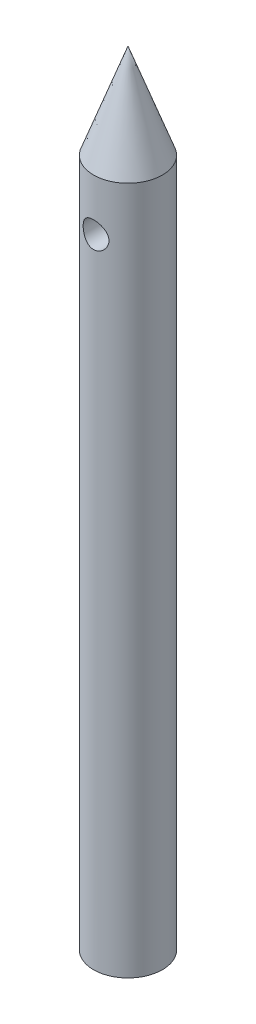
ISO-10303-21;
HEADER;
FILE_DESCRIPTION(('STEP AP214'),'2;1');
FILE_NAME('part.step','',(''),(''),'','','');
FILE_SCHEMA(('AUTOMOTIVE_DESIGN { 1 0 10303 214 1 1 1 1 }'));
ENDSEC;
DATA;
#1=APPLICATION_CONTEXT('core data for automotive mechanical design processes');
#2=APPLICATION_PROTOCOL_DEFINITION('international standard','automotive_design',2000,#1);
#3=PRODUCT_CONTEXT('',#1,'mechanical');
#4=PRODUCT('Part','Part','',(#3));
#5=PRODUCT_RELATED_PRODUCT_CATEGORY('part','',(#4));
#6=PRODUCT_DEFINITION_FORMATION('','',#4);
#7=PRODUCT_DEFINITION_CONTEXT('part definition',#1,'design');
#8=PRODUCT_DEFINITION('design','',#6,#7);
#9=PRODUCT_DEFINITION_SHAPE('','',#8);
#10=(LENGTH_UNIT() NAMED_UNIT(*) SI_UNIT(.MILLI.,.METRE.));
#11=(NAMED_UNIT(*) PLANE_ANGLE_UNIT() SI_UNIT($,.RADIAN.));
#12=(NAMED_UNIT(*) SI_UNIT($,.STERADIAN.) SOLID_ANGLE_UNIT());
#13=UNCERTAINTY_MEASURE_WITH_UNIT(LENGTH_MEASURE(1.E-05),#10,'distance_accuracy_value','');
#14=(GEOMETRIC_REPRESENTATION_CONTEXT(3) GLOBAL_UNCERTAINTY_ASSIGNED_CONTEXT((#13)) GLOBAL_UNIT_ASSIGNED_CONTEXT((#10,
#11,#12)) REPRESENTATION_CONTEXT('',''));
#15=CARTESIAN_POINT('',(0.,0.,0.));
#16=DIRECTION('',(0.,0.,1.));
#17=DIRECTION('',(1.,0.,0.));
#18=AXIS2_PLACEMENT_3D('',#15,#16,#17);
#19=CARTESIAN_POINT('',(0.,40.,0.));
#20=DIRECTION('',(0.,-1.,0.));
#21=DIRECTION('',(0.,0.,1.));
#22=AXIS2_PLACEMENT_3D('',#19,#20,#21);
#23=CONICAL_SURFACE('',#22,2.,0.349065850398867);
#24=CARTESIAN_POINT('',(0.,45.4949548389092,0.));
#25=VERTEX_POINT('',#24);
#26=VERTEX_LOOP('',#25);
#27=FACE_BOUND('',#26,.T.);
#28=CARTESIAN_POINT('',(0.,40.,0.));
#29=DIRECTION('',(0.,1.,0.));
#30=DIRECTION('',(0.,0.,1.));
#31=AXIS2_PLACEMENT_3D('',#28,#29,#30);
#32=CIRCLE('',#31,2.);
#33=CARTESIAN_POINT('',(0.,40.,2.));
#34=VERTEX_POINT('',#33);
#35=EDGE_CURVE('E12',#34,#34,#32,.T.);
#36=ORIENTED_EDGE('',*,*,#35,.T.);
#37=EDGE_LOOP('',(#36));
#38=FACE_BOUND('',#37,.T.);
#39=ADVANCED_FACE('F46',(#27,#38),#23,.T.);
#40=CARTESIAN_POINT('',(0.,40.,0.));
#41=DIRECTION('',(0.,1.,0.));
#42=DIRECTION('',(0.,0.,1.));
#43=AXIS2_PLACEMENT_3D('',#40,#41,#42);
#44=PLANE('',#43);
#45=ORIENTED_EDGE('',*,*,#35,.F.);
#46=EDGE_LOOP('',(#45));
#47=FACE_BOUND('',#46,.T.);
#48=ADVANCED_FACE('F55',(#47),#44,.F.);
#49=CLOSED_SHELL('',(#39,#48));
#50=MANIFOLD_SOLID_BREP('B2',#49);
#51=CARTESIAN_POINT('',(0.,40.,0.));
#52=DIRECTION('',(0.,-1.,0.));
#53=DIRECTION('',(0.,0.,-1.));
#54=AXIS2_PLACEMENT_3D('',#51,#52,#53);
#55=CYLINDRICAL_SURFACE('',#54,2.);
#56=CARTESIAN_POINT('',(0.,37.75,-2.));
#57=CARTESIAN_POINT('',(-0.0406175294689263,37.7500014511516,-2.00000108728076));
#58=CARTESIAN_POINT('',(-0.0812251208908959,37.7466901198758,-1.99875189641592));
#59=CARTESIAN_POINT('',(-0.161226726176181,37.733585902365,-1.99389348003464));
#60=CARTESIAN_POINT('',(-0.200620913993809,37.7237939497647,-1.99028459446997));
#61=CARTESIAN_POINT('',(-0.27703039249544,37.6981234991141,-1.98109416195772));
#62=CARTESIAN_POINT('',(-0.314050112081139,37.6822567415891,-1.9755164217472));
#63=CARTESIAN_POINT('',(-0.384899655080127,37.6449467934921,-1.96294383882677));
#64=CARTESIAN_POINT('',(-0.41872861958894,37.6235021072279,-1.95594861613774));
#65=CARTESIAN_POINT('',(-0.483673208522913,37.5746937344645,-1.94093123485608));
#66=CARTESIAN_POINT('',(-0.514635365075595,37.5471348688703,-1.93288001291783));
#67=CARTESIAN_POINT('',(-0.571622107371815,37.4872947826706,-1.91680110435663));
#68=CARTESIAN_POINT('',(-0.597645181796014,37.4550121219561,-1.90877342567516));
#69=CARTESIAN_POINT('',(-0.644991011079926,37.3851412662384,-1.89331235308866));
#70=CARTESIAN_POINT('',(-0.666096965978799,37.3473978167271,-1.88591324410409));
#71=CARTESIAN_POINT('',(-0.701593231670421,37.2685758229157,-1.87299930118717));
#72=CARTESIAN_POINT('',(-0.715986224806194,37.2274986184224,-1.86748371487941));
#73=CARTESIAN_POINT('',(-0.737042155087745,37.1449416298709,-1.85927206412068));
#74=CARTESIAN_POINT('',(-0.743997966092788,37.1035474807823,-1.85646962175419));
#75=CARTESIAN_POINT('',(-0.750897782658239,37.0200919210031,-1.85369030730607));
#76=CARTESIAN_POINT('',(-0.750844684013152,36.9780307930628,-1.85371226829652));
#77=CARTESIAN_POINT('',(-0.743952148050089,36.8971152373935,-1.85648755816027));
#78=CARTESIAN_POINT('',(-0.737519042545016,36.8582195469779,-1.85907734435561));
#79=CARTESIAN_POINT('',(-0.718720839341648,36.7821064247973,-1.86642469029765));
#80=CARTESIAN_POINT('',(-0.706354848316289,36.744889246693,-1.87118257649432));
#81=CARTESIAN_POINT('',(-0.675818742859516,36.6723614661359,-1.88242851095127));
#82=CARTESIAN_POINT('',(-0.6575432436855,36.6371002569393,-1.88894758994083));
#83=CARTESIAN_POINT('',(-0.615780368813487,36.5700271312045,-1.9029710506966));
#84=CARTESIAN_POINT('',(-0.592291193644482,36.5382164112401,-1.91047577228579));
#85=CARTESIAN_POINT('',(-0.538908903832743,36.4766981681746,-1.92624019429557));
#86=CARTESIAN_POINT('',(-0.508691493584776,36.447275679626,-1.93451673727835));
#87=CARTESIAN_POINT('',(-0.443656295409508,36.3938310168971,-1.95045864082043));
#88=CARTESIAN_POINT('',(-0.408837801748679,36.3698096726972,-1.95812390732976));
#89=CARTESIAN_POINT('',(-0.334861718496207,36.3275348014687,-1.9721319740454));
#90=CARTESIAN_POINT('',(-0.295645356922356,36.3093762093895,-1.97845249129808));
#91=CARTESIAN_POINT('',(-0.214418425262289,36.280008697865,-1.98889359163481));
#92=CARTESIAN_POINT('',(-0.172409105422882,36.2687966917194,-1.99301515170746));
#93=CARTESIAN_POINT('',(-0.0891876215743313,36.254188606229,-1.99842221614033));
#94=CARTESIAN_POINT('',(-0.0480518097811023,36.2504086968087,-1.99984684512846));
#95=CARTESIAN_POINT('',(0.0342862376275118,36.24965446805,-2.0001294685006));
#96=CARTESIAN_POINT('',(0.0754884564916824,36.2526786398416,-1.99898803193422));
#97=CARTESIAN_POINT('',(0.155131024280936,36.2651550211543,-1.99435854886331));
#98=CARTESIAN_POINT('',(0.193616664003687,36.2743557718686,-1.99096235481185));
#99=CARTESIAN_POINT('',(0.268470877478596,36.2985930362736,-1.98225738545826));
#100=CARTESIAN_POINT('',(0.304839175173707,36.3136303089739,-1.97694836140892));
#101=CARTESIAN_POINT('',(0.375623882555142,36.3495932062199,-1.96474812203967));
#102=CARTESIAN_POINT('',(0.40995154177914,36.3706788646122,-1.95781500105154));
#103=CARTESIAN_POINT('',(0.474696355863068,36.4179590515853,-1.94313335781852));
#104=CARTESIAN_POINT('',(0.505112060134315,36.4441554662707,-1.93538453502966));
#105=CARTESIAN_POINT('',(0.563015399373234,36.5027020610642,-1.91936664747391));
#106=CARTESIAN_POINT('',(0.590230770621531,36.5353210913942,-1.91109348259133));
#107=CARTESIAN_POINT('',(0.638855250155825,36.604825692346,-1.89539407866158));
#108=CARTESIAN_POINT('',(0.660263837058794,36.6417116456651,-1.88796791570019));
#109=CARTESIAN_POINT('',(0.696688867605184,36.7190079934077,-1.87483414938657));
#110=CARTESIAN_POINT('',(0.711678427280393,36.7594323730486,-1.86913380266548));
#111=CARTESIAN_POINT('',(0.734539417381085,36.8425048819416,-1.86027016547258));
#112=CARTESIAN_POINT('',(0.742415251539797,36.8851516181292,-1.85710530555167));
#113=CARTESIAN_POINT('',(0.750431735478742,36.9685080797516,-1.85387947371526));
#114=CARTESIAN_POINT('',(0.751036657476388,37.0091663158534,-1.85363222255043));
#115=CARTESIAN_POINT('',(0.74568357821076,37.0899726581432,-1.85579206379273));
#116=CARTESIAN_POINT('',(0.739726199251356,37.1301208123371,-1.858198904512));
#117=CARTESIAN_POINT('',(0.721779078150489,37.207523613357,-1.86524070791019));
#118=CARTESIAN_POINT('',(0.709978991582424,37.2448291731223,-1.86980542687876));
#119=CARTESIAN_POINT('',(0.680848483899787,37.3169527542476,-1.88060774149378));
#120=CARTESIAN_POINT('',(0.663516664724774,37.3517701440352,-1.88684575997732));
#121=CARTESIAN_POINT('',(0.622760379690712,37.4199133948487,-1.90069861951851));
#122=CARTESIAN_POINT('',(0.599064164015034,37.4530653983999,-1.90836849220447));
#123=CARTESIAN_POINT('',(0.546672428649542,37.5150707804856,-1.92403123378624));
#124=CARTESIAN_POINT('',(0.517975320064043,37.5439227873934,-1.93202420471582));
#125=CARTESIAN_POINT('',(0.454540198392304,37.5981009779109,-1.9479521230493));
#126=CARTESIAN_POINT('',(0.41955932210649,37.6231518767173,-1.9558605245032));
#127=CARTESIAN_POINT('',(0.345606611600407,37.6670113276383,-1.97027257228518));
#128=CARTESIAN_POINT('',(0.306634467045308,37.6858193938682,-1.9767761092578));
#129=CARTESIAN_POINT('',(0.223999541001155,37.7171884145242,-1.98787146303339));
#130=CARTESIAN_POINT('',(0.180206711117103,37.7294435323009,-1.99236828579178));
#131=CARTESIAN_POINT('',(0.0909378668031901,37.7458464799603,-1.99843121089794));
#132=CARTESIAN_POINT('',(0.0454627081824291,37.7499983757437,-1.99999878301984));
#133=CARTESIAN_POINT('',(0.,37.75,-2.));
#134=B_SPLINE_CURVE_WITH_KNOTS('',3,(#56,#57,#58,#59,#60,#61,#62,#63,#64,#65,#66,#67,#68,#69,
#70,#71,#72,#73,#74,#75,#76,#77,#78,#79,#80,#81,#82,#83,#84,#85,#86,#87,#88,#89,#90,#91,#92,#93,
#94,#95,#96,#97,#98,#99,#100,#101,#102,#103,#104,#105,#106,#107,#108,#109,#110,#111,#112,#113,
#114,#115,#116,#117,#118,#119,#120,#121,#122,#123,#124,#125,#126,#127,#128,#129,#130,#131,#132,
#133),.UNSPECIFIED.,.T.,.F.,(4,2,2,2,2,2,2,2,2,2,2,2,2,2,2,2,2,2,2,2,2,2,2,2,2,2,2,2,2,2,2,2,2,
2,2,2,2,2,4),(0.,0.12168490078028,0.24335227476523,0.364785684606788,0.486251689804743,
0.61236809291358,0.738523024628113,0.869483372508297,1.00039134676067,1.12592937208451,
1.25141553039854,1.36939172559986,1.48738569030295,1.60761204193509,1.72787995372129,
1.85623076667906,1.98460128952533,2.11495687643038,2.24525449849423,2.36862509817963,
2.4919683419526,2.6105721896192,2.72919146627226,2.851296109298,2.97344590009933,
3.10268259727829,3.2319308946007,3.36171533360999,3.49141937472668,3.61279381734541,
3.73415675100045,3.85181571207682,3.96950443322668,4.09336235936551,4.21725970992946,
4.34786164821435,4.47847374896966,4.61474257510436,4.75094300892478),.UNSPECIFIED.);
#135=CARTESIAN_POINT('',(0.,37.75,-2.));
#136=VERTEX_POINT('',#135);
#137=EDGE_CURVE('E45',#136,#136,#134,.T.);
#138=ORIENTED_EDGE('',*,*,#137,.T.);
#139=EDGE_LOOP('',(#138));
#140=FACE_BOUND('',#139,.T.);
#141=CARTESIAN_POINT('',(0.749999999999999,37.,1.85404962177392));
#142=CARTESIAN_POINT('',(0.750001520530545,36.9594962581396,1.85404820316903));
#143=CARTESIAN_POINT('',(0.746707987747435,36.9190025387482,1.85539130120493));
#144=CARTESIAN_POINT('',(0.733680939477338,36.8392359585434,1.86058079652483));
#145=CARTESIAN_POINT('',(0.723947616866315,36.7999630612025,1.86442711883556));
#146=CARTESIAN_POINT('',(0.698448288052867,36.7238123141932,1.8741274014045));
#147=CARTESIAN_POINT('',(0.682696736331738,36.6869289716744,1.8799765478463));
#148=CARTESIAN_POINT('',(0.645659283713483,36.6163140515906,1.89301567103299));
#149=CARTESIAN_POINT('',(0.624371720475191,36.5825834248587,1.90020605033662));
#150=CARTESIAN_POINT('',(0.575733306870811,36.5175548441886,1.91551787332856));
#151=CARTESIAN_POINT('',(0.548151906066534,36.4864357351853,1.92366670961802));
#152=CARTESIAN_POINT('',(0.488197919889466,36.4291385926643,1.93974875314273));
#153=CARTESIAN_POINT('',(0.455824315128341,36.4029616131291,1.94768191407392));
#154=CARTESIAN_POINT('',(0.3858473275888,36.3554302438522,1.96276436968277));
#155=CARTESIAN_POINT('',(0.348103473769014,36.3342702626421,1.96987780611753));
#156=CARTESIAN_POINT('',(0.269277885982623,36.2986744137375,1.98219003986924));
#157=CARTESIAN_POINT('',(0.228197315466768,36.284236214004,1.98738950108503));
#158=CARTESIAN_POINT('',(0.145744670838416,36.2631210521127,1.9950934855172));
#159=CARTESIAN_POINT('',(0.104461598640799,36.2561361862798,1.99770457607387));
#160=CARTESIAN_POINT('',(0.0212321818973935,36.2491393995275,2.0003200705397));
#161=CARTESIAN_POINT('',(-0.020713942531416,36.2491252111907,2.00032532207451));
#162=CARTESIAN_POINT('',(-0.101871771532238,36.2558908807326,1.99779632951947));
#163=CARTESIAN_POINT('',(-0.141116089133451,36.2623346489744,1.99538770998341));
#164=CARTESIAN_POINT('',(-0.217919608992196,36.2812679576128,1.98846637466131));
#165=CARTESIAN_POINT('',(-0.255478691715148,36.293757926131,1.98395350987789));
#166=CARTESIAN_POINT('',(-0.32849450865155,36.3245852258379,1.97318884583765));
#167=CARTESIAN_POINT('',(-0.363912696143654,36.3430050026342,1.96691269735038));
#168=CARTESIAN_POINT('',(-0.431243303978779,36.3850960484647,1.9532565511264));
#169=CARTESIAN_POINT('',(-0.46315458846616,36.4087690115088,1.9458761975642));
#170=CARTESIAN_POINT('',(-0.524545243400466,36.4623136431416,1.93026264827908));
#171=CARTESIAN_POINT('',(-0.55377307263174,36.4924669578252,1.92200481881941));
#172=CARTESIAN_POINT('',(-0.606851977846712,36.5572964966608,1.90591230322861));
#173=CARTESIAN_POINT('',(-0.630701703464498,36.5919738532933,1.89807772374424));
#174=CARTESIAN_POINT('',(-0.672828059040755,36.6658597337314,1.88356351750168));
#175=CARTESIAN_POINT('',(-0.690969239259151,36.705151746843,1.87691338575138));
#176=CARTESIAN_POINT('',(-0.720282322207503,36.7865481125838,1.86586219314501));
#177=CARTESIAN_POINT('',(-0.731458103027973,36.8286508857968,1.86145988102892));
#178=CARTESIAN_POINT('',(-0.74595095854834,36.911987981158,1.85569798611424));
#179=CARTESIAN_POINT('',(-0.749667605794829,36.9531420527681,1.85418392620769));
#180=CARTESIAN_POINT('',(-0.750289428181359,37.0355046783709,1.85393269762508));
#181=CARTESIAN_POINT('',(-0.747196305468807,37.0767132161762,1.85519483501993));
#182=CARTESIAN_POINT('',(-0.734648667600783,37.1559649611438,1.86019690814868));
#183=CARTESIAN_POINT('',(-0.725503091671122,37.1940655678823,1.86381638108224));
#184=CARTESIAN_POINT('',(-0.701498873203187,37.2681739723601,1.87298243523181));
#185=CARTESIAN_POINT('',(-0.686639060173114,37.3041813395841,1.87852941125086));
#186=CARTESIAN_POINT('',(-0.651001461376389,37.3745822190381,1.8911812155804));
#187=CARTESIAN_POINT('',(-0.630022725885233,37.4088646460687,1.89833664446032));
#188=CARTESIAN_POINT('',(-0.582956589312395,37.473564490863,1.91331407147146));
#189=CARTESIAN_POINT('',(-0.556867318482173,37.5039804873123,1.92113631297039));
#190=CARTESIAN_POINT('',(-0.498363670450469,37.5620841865975,1.93716523276592));
#191=CARTESIAN_POINT('',(-0.46565317074553,37.5894767043844,1.94536484678514));
#192=CARTESIAN_POINT('',(-0.395898735876574,37.6384191837947,1.96074937481651));
#193=CARTESIAN_POINT('',(-0.358854786661337,37.6599691264729,1.96793428553832));
#194=CARTESIAN_POINT('',(-0.281508164734239,37.6964730280998,1.98047492852276));
#195=CARTESIAN_POINT('',(-0.241217216532314,37.7114495618963,1.98583690669005));
#196=CARTESIAN_POINT('',(-0.158440943761627,37.734328206925,1.99414718356286));
#197=CARTESIAN_POINT('',(-0.115956660361795,37.7422336427112,1.99709661649706));
#198=CARTESIAN_POINT('',(-0.0326677926369063,37.7503872013774,2.00014203658537));
#199=CARTESIAN_POINT('',(0.0080903840304237,37.7510547415295,2.00039430476882));
#200=CARTESIAN_POINT('',(0.0891133932062123,37.7457924202773,1.99842444904612));
#201=CARTESIAN_POINT('',(0.129378284622629,37.7398633545571,1.99620262356565));
#202=CARTESIAN_POINT('',(0.207274124188562,37.7218705742532,1.98960544801886));
#203=CARTESIAN_POINT('',(0.244945365534415,37.7099600470608,1.98528395689009));
#204=CARTESIAN_POINT('',(0.317757736503192,37.6804949933078,1.97493891810495));
#205=CARTESIAN_POINT('',(0.35289838563777,37.6629393983476,1.96891504827832));
#206=CARTESIAN_POINT('',(0.421270088497205,37.6218430282476,1.95545309150037));
#207=CARTESIAN_POINT('',(0.454358774423422,37.5980816797429,1.94796620054414));
#208=CARTESIAN_POINT('',(0.516208673761678,37.5455960849062,1.93249753847422));
#209=CARTESIAN_POINT('',(0.544968335627948,37.5168700670961,1.92451559137014));
#210=CARTESIAN_POINT('',(0.598906071180977,37.4534679341775,1.90844064869588));
#211=CARTESIAN_POINT('',(0.623814999080124,37.4185577989228,1.9003640267458));
#212=CARTESIAN_POINT('',(0.667423547784214,37.3447920652133,1.88549162501819));
#213=CARTESIAN_POINT('',(0.686122524390781,37.3059360579733,1.87869597815608));
#214=CARTESIAN_POINT('',(0.717329434871299,37.2235221595123,1.86701134926633));
#215=CARTESIAN_POINT('',(0.729530014497612,37.1798328167441,1.8622190164543));
#216=CARTESIAN_POINT('',(0.745861783610395,37.0907573640221,1.85573997168158));
#217=CARTESIAN_POINT('',(0.749998296697852,37.045372393645,1.85405121089868));
#218=CARTESIAN_POINT('',(0.749999999999999,37.,1.85404962177392));
#219=B_SPLINE_CURVE_WITH_KNOTS('',3,(#141,#142,#143,#144,#145,#146,#147,#148,#149,#150,#151,
#152,#153,#154,#155,#156,#157,#158,#159,#160,#161,#162,#163,#164,#165,#166,#167,#168,#169,#170,
#171,#172,#173,#174,#175,#176,#177,#178,#179,#180,#181,#182,#183,#184,#185,#186,#187,#188,#189,
#190,#191,#192,#193,#194,#195,#196,#197,#198,#199,#200,#201,#202,#203,#204,#205,#206,#207,#208,
#209,#210,#211,#212,#213,#214,#215,#216,#217,#218),.UNSPECIFIED.,.T.,.F.,(4,2,2,2,2,2,2,2,2,2,2,
2,2,2,2,2,2,2,2,2,2,2,2,2,2,2,2,2,2,2,2,2,2,2,2,2,2,2,4),(0.,0.121342270708086,
0.242680907299427,0.363729928378528,0.484815339841463,0.611373262005635,0.737958144114913,
0.868850360682107,0.999697131906648,1.12490009244839,1.25006232702428,1.36903236401597,
1.48801082631667,1.60872065605333,1.72946946814488,1.85728337532937,1.98512933913667,
2.11581296126482,2.24642375817736,2.36982828870242,2.49320197694442,2.61071922964099,
2.72826056714763,2.8502078050291,2.97219974233177,3.10192508496812,3.23165084825089,
3.36092754445084,3.49014342780063,3.61182860274968,3.73349910159739,3.85220137001945,
3.97092611756415,4.09464161838493,4.21840135447482,4.34869299771039,4.47899815272121,
4.61501589435462,4.75094381161526),.UNSPECIFIED.);
#220=CARTESIAN_POINT('',(0.749999999999999,37.,1.85404962177392));
#221=VERTEX_POINT('',#220);
#222=EDGE_CURVE('E84',#221,#221,#219,.T.);
#223=ORIENTED_EDGE('',*,*,#222,.T.);
#224=EDGE_LOOP('',(#223));
#225=FACE_BOUND('',#224,.T.);
#226=CARTESIAN_POINT('',(0.,40.,0.));
#227=DIRECTION('',(0.,1.,0.));
#228=DIRECTION('',(0.,0.,1.));
#229=AXIS2_PLACEMENT_3D('',#226,#227,#228);
#230=CIRCLE('',#229,2.);
#231=CARTESIAN_POINT('',(0.,40.,2.));
#232=VERTEX_POINT('',#231);
#233=EDGE_CURVE('E88',#232,#232,#230,.T.);
#234=ORIENTED_EDGE('',*,*,#233,.F.);
#235=EDGE_LOOP('',(#234));
#236=FACE_BOUND('',#235,.T.);
#237=CARTESIAN_POINT('',(0.,0.,0.));
#238=DIRECTION('',(0.,1.,0.));
#239=DIRECTION('',(0.,0.,1.));
#240=AXIS2_PLACEMENT_3D('',#237,#238,#239);
#241=CIRCLE('',#240,2.);
#242=CARTESIAN_POINT('',(0.,0.,2.));
#243=VERTEX_POINT('',#242);
#244=EDGE_CURVE('E92',#243,#243,#241,.T.);
#245=ORIENTED_EDGE('',*,*,#244,.T.);
#246=EDGE_LOOP('',(#245));
#247=FACE_BOUND('',#246,.T.);
#248=ADVANCED_FACE('F73',(#140,#225,#236,#247),#55,.T.);
#249=CARTESIAN_POINT('',(0.,40.,0.));
#250=DIRECTION('',(0.,1.,0.));
#251=DIRECTION('',(0.,0.,1.));
#252=AXIS2_PLACEMENT_3D('',#249,#250,#251);
#253=PLANE('',#252);
#254=ORIENTED_EDGE('',*,*,#233,.T.);
#255=EDGE_LOOP('',(#254));
#256=FACE_BOUND('',#255,.T.);
#257=ADVANCED_FACE('F104',(#256),#253,.T.);
#258=CARTESIAN_POINT('',(0.,0.,0.));
#259=DIRECTION('',(0.,1.,0.));
#260=DIRECTION('',(0.,0.,1.));
#261=AXIS2_PLACEMENT_3D('',#258,#259,#260);
#262=PLANE('',#261);
#263=ORIENTED_EDGE('',*,*,#244,.F.);
#264=EDGE_LOOP('',(#263));
#265=FACE_BOUND('',#264,.T.);
#266=ADVANCED_FACE('F102',(#265),#262,.F.);
#267=CARTESIAN_POINT('',(0.,37.,2.));
#268=DIRECTION('',(0.,0.,1.));
#269=DIRECTION('',(1.,0.,0.));
#270=AXIS2_PLACEMENT_3D('',#267,#268,#269);
#271=CYLINDRICAL_SURFACE('',#270,0.749999999999999);
#272=ORIENTED_EDGE('',*,*,#222,.F.);
#273=EDGE_LOOP('',(#272));
#274=FACE_BOUND('',#273,.T.);
#275=ORIENTED_EDGE('',*,*,#137,.F.);
#276=EDGE_LOOP('',(#275));
#277=FACE_BOUND('',#276,.T.);
#278=ADVANCED_FACE('F98',(#274,#277),#271,.F.);
#279=CLOSED_SHELL('',(#248,#257,#266,#278));
#280=MANIFOLD_SOLID_BREP('B6',#279);
#281=ADVANCED_BREP_SHAPE_REPRESENTATION('',(#18,#50,#280),#14);
#282=SHAPE_DEFINITION_REPRESENTATION(#9,#281);
ENDSEC;
END-ISO-10303-21;
